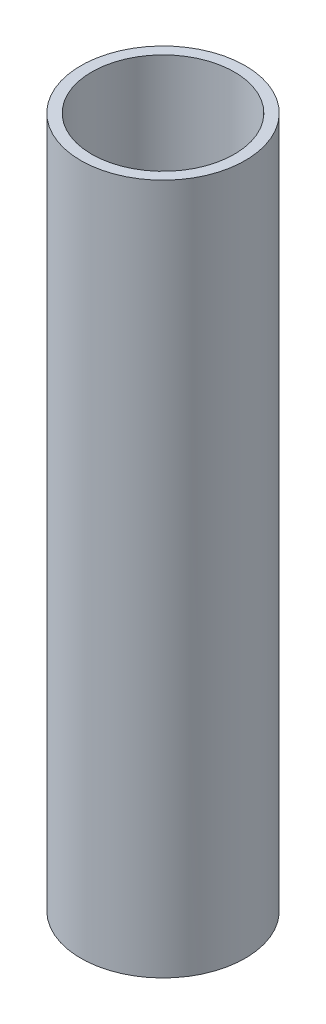
ISO-10303-21;
HEADER;
FILE_DESCRIPTION(('STEP AP214'),'2;1');
FILE_NAME('part.step','',(''),(''),'','','');
FILE_SCHEMA(('AUTOMOTIVE_DESIGN { 1 0 10303 214 1 1 1 1 }'));
ENDSEC;
DATA;
#1=APPLICATION_CONTEXT('core data for automotive mechanical design processes');
#2=APPLICATION_PROTOCOL_DEFINITION('international standard','automotive_design',2000,#1);
#3=PRODUCT_CONTEXT('',#1,'mechanical');
#4=PRODUCT('Part','Part','',(#3));
#5=PRODUCT_RELATED_PRODUCT_CATEGORY('part','',(#4));
#6=PRODUCT_DEFINITION_FORMATION('','',#4);
#7=PRODUCT_DEFINITION_CONTEXT('part definition',#1,'design');
#8=PRODUCT_DEFINITION('design','',#6,#7);
#9=PRODUCT_DEFINITION_SHAPE('','',#8);
#10=(LENGTH_UNIT() NAMED_UNIT(*) SI_UNIT(.MILLI.,.METRE.));
#11=(NAMED_UNIT(*) PLANE_ANGLE_UNIT() SI_UNIT($,.RADIAN.));
#12=(NAMED_UNIT(*) SI_UNIT($,.STERADIAN.) SOLID_ANGLE_UNIT());
#13=UNCERTAINTY_MEASURE_WITH_UNIT(LENGTH_MEASURE(1.E-05),#10,'distance_accuracy_value','');
#14=(GEOMETRIC_REPRESENTATION_CONTEXT(3) GLOBAL_UNCERTAINTY_ASSIGNED_CONTEXT((#13)) GLOBAL_UNIT_ASSIGNED_CONTEXT((#10,
#11,#12)) REPRESENTATION_CONTEXT('',''));
#15=CARTESIAN_POINT('',(0.,0.,0.));
#16=DIRECTION('',(0.,0.,1.));
#17=DIRECTION('',(1.,0.,0.));
#18=AXIS2_PLACEMENT_3D('',#15,#16,#17);
#19=CARTESIAN_POINT('',(0.,102.,0.));
#20=DIRECTION('',(0.,1.,0.));
#21=DIRECTION('',(0.,0.,1.));
#22=AXIS2_PLACEMENT_3D('',#19,#20,#21);
#23=PLANE('',#22);
#24=CARTESIAN_POINT('',(0.,102.,0.));
#25=DIRECTION('',(0.,1.,0.));
#26=DIRECTION('',(0.,0.,1.));
#27=AXIS2_PLACEMENT_3D('',#24,#25,#26);
#28=CIRCLE('',#27,12.85);
#29=CARTESIAN_POINT('',(0.,102.,12.85));
#30=VERTEX_POINT('',#29);
#31=EDGE_CURVE('E10',#30,#30,#28,.T.);
#32=ORIENTED_EDGE('',*,*,#31,.T.);
#33=EDGE_LOOP('',(#32));
#34=FACE_BOUND('',#33,.T.);
#35=CARTESIAN_POINT('',(0.,102.,0.));
#36=DIRECTION('',(0.,1.,0.));
#37=DIRECTION('',(0.,0.,1.));
#38=AXIS2_PLACEMENT_3D('',#35,#36,#37);
#39=CIRCLE('',#38,11.15);
#40=CARTESIAN_POINT('',(0.,102.,11.15));
#41=VERTEX_POINT('',#40);
#42=EDGE_CURVE('E38',#41,#41,#39,.T.);
#43=ORIENTED_EDGE('',*,*,#42,.F.);
#44=EDGE_LOOP('',(#43));
#45=FACE_BOUND('',#44,.T.);
#46=ADVANCED_FACE('F31',(#34,#45),#23,.T.);
#47=CARTESIAN_POINT('',(0.,102.,0.));
#48=DIRECTION('',(0.,-1.,0.));
#49=DIRECTION('',(0.,0.,-1.));
#50=AXIS2_PLACEMENT_3D('',#47,#48,#49);
#51=CYLINDRICAL_SURFACE('',#50,12.85);
#52=ORIENTED_EDGE('',*,*,#31,.F.);
#53=EDGE_LOOP('',(#52));
#54=FACE_BOUND('',#53,.T.);
#55=CARTESIAN_POINT('',(0.,-6.,0.));
#56=DIRECTION('',(0.,-1.,0.));
#57=DIRECTION('',(0.,0.,-1.));
#58=AXIS2_PLACEMENT_3D('',#55,#56,#57);
#59=CIRCLE('',#58,12.85);
#60=CARTESIAN_POINT('',(0.,-6.,-12.85));
#61=VERTEX_POINT('',#60);
#62=EDGE_CURVE('E47',#61,#61,#59,.T.);
#63=ORIENTED_EDGE('',*,*,#62,.F.);
#64=EDGE_LOOP('',(#63));
#65=FACE_BOUND('',#64,.T.);
#66=ADVANCED_FACE('F33',(#54,#65),#51,.T.);
#67=CARTESIAN_POINT('',(0.,102.,0.));
#68=DIRECTION('',(0.,-1.,0.));
#69=DIRECTION('',(0.,0.,-1.));
#70=AXIS2_PLACEMENT_3D('',#67,#68,#69);
#71=CYLINDRICAL_SURFACE('',#70,11.15);
#72=ORIENTED_EDGE('',*,*,#42,.T.);
#73=EDGE_LOOP('',(#72));
#74=FACE_BOUND('',#73,.T.);
#75=CARTESIAN_POINT('',(0.,0.,0.));
#76=DIRECTION('',(0.,1.,0.));
#77=DIRECTION('',(0.,0.,1.));
#78=AXIS2_PLACEMENT_3D('',#75,#76,#77);
#79=CIRCLE('',#78,11.15);
#80=CARTESIAN_POINT('',(0.,0.,11.15));
#81=VERTEX_POINT('',#80);
#82=EDGE_CURVE('E42',#81,#81,#79,.T.);
#83=ORIENTED_EDGE('',*,*,#82,.F.);
#84=EDGE_LOOP('',(#83));
#85=FACE_BOUND('',#84,.T.);
#86=ADVANCED_FACE('F55',(#74,#85),#71,.F.);
#87=CARTESIAN_POINT('',(0.,0.,0.));
#88=DIRECTION('',(0.,-1.,0.));
#89=DIRECTION('',(0.,0.,-1.));
#90=AXIS2_PLACEMENT_3D('',#87,#88,#89);
#91=PLANE('',#90);
#92=ORIENTED_EDGE('',*,*,#82,.T.);
#93=EDGE_LOOP('',(#92));
#94=FACE_BOUND('',#93,.T.);
#95=ADVANCED_FACE('F61',(#94),#91,.F.);
#96=CARTESIAN_POINT('',(0.,-6.,0.));
#97=DIRECTION('',(0.,-1.,0.));
#98=DIRECTION('',(0.,0.,-1.));
#99=AXIS2_PLACEMENT_3D('',#96,#97,#98);
#100=PLANE('',#99);
#101=ORIENTED_EDGE('',*,*,#62,.T.);
#102=EDGE_LOOP('',(#101));
#103=FACE_BOUND('',#102,.T.);
#104=ADVANCED_FACE('F52',(#103),#100,.T.);
#105=CLOSED_SHELL('',(#46,#66,#86,#95,#104));
#106=MANIFOLD_SOLID_BREP('B2',#105);
#107=ADVANCED_BREP_SHAPE_REPRESENTATION('',(#18,#106),#14);
#108=SHAPE_DEFINITION_REPRESENTATION(#9,#107);
ENDSEC;
END-ISO-10303-21;
